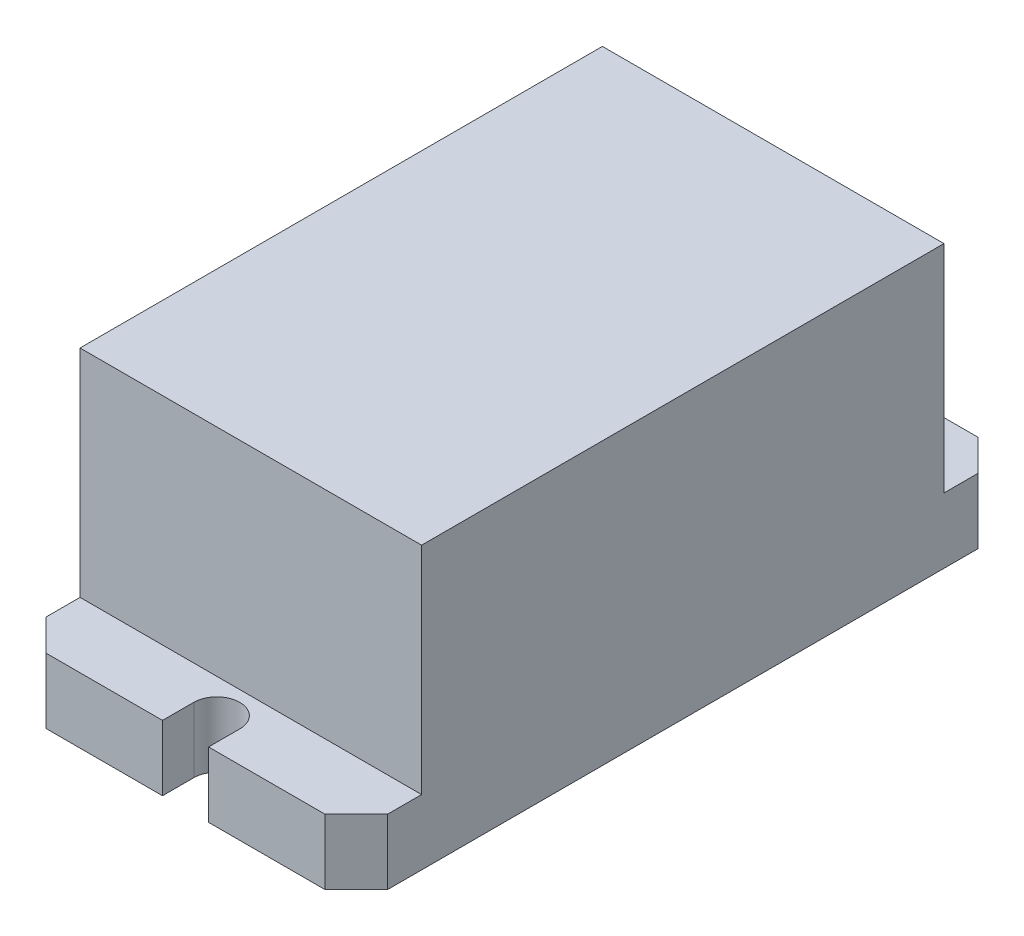
ISO-10303-21;
HEADER;
FILE_DESCRIPTION(('STEP AP214'),'2;1');
FILE_NAME('part.step','',(''),(''),'','','');
FILE_SCHEMA(('AUTOMOTIVE_DESIGN { 1 0 10303 214 1 1 1 1 }'));
ENDSEC;
DATA;
#1=APPLICATION_CONTEXT('core data for automotive mechanical design processes');
#2=APPLICATION_PROTOCOL_DEFINITION('international standard','automotive_design',2000,#1);
#3=PRODUCT_CONTEXT('',#1,'mechanical');
#4=PRODUCT('Part','Part','',(#3));
#5=PRODUCT_RELATED_PRODUCT_CATEGORY('part','',(#4));
#6=PRODUCT_DEFINITION_FORMATION('','',#4);
#7=PRODUCT_DEFINITION_CONTEXT('part definition',#1,'design');
#8=PRODUCT_DEFINITION('design','',#6,#7);
#9=PRODUCT_DEFINITION_SHAPE('','',#8);
#10=(LENGTH_UNIT() NAMED_UNIT(*) SI_UNIT(.MILLI.,.METRE.));
#11=(NAMED_UNIT(*) PLANE_ANGLE_UNIT() SI_UNIT($,.RADIAN.));
#12=(NAMED_UNIT(*) SI_UNIT($,.STERADIAN.) SOLID_ANGLE_UNIT());
#13=UNCERTAINTY_MEASURE_WITH_UNIT(LENGTH_MEASURE(1.E-05),#10,'distance_accuracy_value','');
#14=(GEOMETRIC_REPRESENTATION_CONTEXT(3) GLOBAL_UNCERTAINTY_ASSIGNED_CONTEXT((#13)) GLOBAL_UNIT_ASSIGNED_CONTEXT((#10,
#11,#12)) REPRESENTATION_CONTEXT('',''));
#15=CARTESIAN_POINT('',(0.,0.,0.));
#16=DIRECTION('',(0.,0.,1.));
#17=DIRECTION('',(1.,0.,0.));
#18=AXIS2_PLACEMENT_3D('',#15,#16,#17);
#19=CARTESIAN_POINT('',(0.,35.56,-33.02));
#20=DIRECTION('',(0.,0.,-1.));
#21=DIRECTION('',(-1.,0.,0.));
#22=AXIS2_PLACEMENT_3D('',#19,#20,#21);
#23=PLANE('',#22);
#24=DIRECTION('',(1.,0.,0.));
#25=VECTOR('',#24,1.);
#26=CARTESIAN_POINT('',(0.,8.255,-33.02));
#27=LINE('',#26,#25);
#28=CARTESIAN_POINT('',(-21.59,8.255,-33.02));
#29=VERTEX_POINT('',#28);
#30=CARTESIAN_POINT('',(21.59,8.255,-33.02));
#31=VERTEX_POINT('',#30);
#32=EDGE_CURVE('E56',#29,#31,#27,.T.);
#33=ORIENTED_EDGE('',*,*,#32,.F.);
#34=DIRECTION('',(0.,-1.,0.));
#35=VECTOR('',#34,1.);
#36=CARTESIAN_POINT('',(-21.59,35.56,-33.02));
#37=LINE('',#36,#35);
#38=CARTESIAN_POINT('',(-21.59,35.56,-33.02));
#39=VERTEX_POINT('',#38);
#40=EDGE_CURVE('E11',#39,#29,#37,.T.);
#41=ORIENTED_EDGE('',*,*,#40,.F.);
#42=DIRECTION('',(1.,0.,0.));
#43=VECTOR('',#42,1.);
#44=CARTESIAN_POINT('',(0.,35.56,-33.02));
#45=LINE('',#44,#43);
#46=CARTESIAN_POINT('',(21.59,35.56,-33.02));
#47=VERTEX_POINT('',#46);
#48=EDGE_CURVE('E362',#39,#47,#45,.T.);
#49=ORIENTED_EDGE('',*,*,#48,.T.);
#50=DIRECTION('',(0.,-1.,0.));
#51=VECTOR('',#50,1.);
#52=CARTESIAN_POINT('',(21.59,35.56,-33.02));
#53=LINE('',#52,#51);
#54=EDGE_CURVE('E258',#47,#31,#53,.T.);
#55=ORIENTED_EDGE('',*,*,#54,.T.);
#56=EDGE_LOOP('',(#33,#41,#49,#55));
#57=FACE_BOUND('',#56,.T.);
#58=ADVANCED_FACE('F41',(#57),#23,.T.);
#59=CARTESIAN_POINT('',(-21.59,35.56,0.));
#60=DIRECTION('',(-1.,0.,0.));
#61=DIRECTION('',(0.,0.,1.));
#62=AXIS2_PLACEMENT_3D('',#59,#60,#61);
#63=PLANE('',#62);
#64=DIRECTION('',(0.,0.,-1.));
#65=VECTOR('',#64,1.);
#66=CARTESIAN_POINT('',(-21.59,0.,0.));
#67=LINE('',#66,#65);
#68=CARTESIAN_POINT('',(-21.59,0.,37.3238335973469));
#69=VERTEX_POINT('',#68);
#70=CARTESIAN_POINT('',(-21.59,0.,-37.3238335973469));
#71=VERTEX_POINT('',#70);
#72=EDGE_CURVE('E361',#69,#71,#67,.T.);
#73=ORIENTED_EDGE('',*,*,#72,.F.);
#74=DIRECTION('',(0.,-1.,0.));
#75=VECTOR('',#74,1.);
#76=CARTESIAN_POINT('',(-21.59,8.255,37.3238335973469));
#77=LINE('',#76,#75);
#78=CARTESIAN_POINT('',(-21.59,8.255,37.3238335973469));
#79=VERTEX_POINT('',#78);
#80=EDGE_CURVE('E279',#79,#69,#77,.T.);
#81=ORIENTED_EDGE('',*,*,#80,.F.);
#82=DIRECTION('',(0.,0.,1.));
#83=VECTOR('',#82,1.);
#84=CARTESIAN_POINT('',(-21.59,8.255,0.));
#85=LINE('',#84,#83);
#86=CARTESIAN_POINT('',(-21.59,8.255,33.02));
#87=VERTEX_POINT('',#86);
#88=EDGE_CURVE('E272',#87,#79,#85,.T.);
#89=ORIENTED_EDGE('',*,*,#88,.F.);
#90=DIRECTION('',(0.,-1.,0.));
#91=VECTOR('',#90,1.);
#92=CARTESIAN_POINT('',(-21.59,35.56,33.02));
#93=LINE('',#92,#91);
#94=CARTESIAN_POINT('',(-21.59,35.56,33.02));
#95=VERTEX_POINT('',#94);
#96=EDGE_CURVE('E308',#95,#87,#93,.T.);
#97=ORIENTED_EDGE('',*,*,#96,.F.);
#98=DIRECTION('',(0.,0.,-1.));
#99=VECTOR('',#98,1.);
#100=CARTESIAN_POINT('',(-21.59,35.56,0.));
#101=LINE('',#100,#99);
#102=EDGE_CURVE('E49',#95,#39,#101,.T.);
#103=ORIENTED_EDGE('',*,*,#102,.T.);
#104=ORIENTED_EDGE('',*,*,#40,.T.);
#105=DIRECTION('',(0.,0.,-1.));
#106=VECTOR('',#105,1.);
#107=CARTESIAN_POINT('',(-21.59,8.255,0.));
#108=LINE('',#107,#106);
#109=CARTESIAN_POINT('',(-21.59,8.255,-37.3238335973469));
#110=VERTEX_POINT('',#109);
#111=EDGE_CURVE('E329',#29,#110,#108,.T.);
#112=ORIENTED_EDGE('',*,*,#111,.T.);
#113=DIRECTION('',(0.,-1.,0.));
#114=VECTOR('',#113,1.);
#115=CARTESIAN_POINT('',(-21.59,8.255,-37.3238335973469));
#116=LINE('',#115,#114);
#117=EDGE_CURVE('E335',#110,#71,#116,.T.);
#118=ORIENTED_EDGE('',*,*,#117,.T.);
#119=EDGE_LOOP('',(#73,#81,#89,#97,#103,#104,#112,#118));
#120=FACE_BOUND('',#119,.T.);
#121=ADVANCED_FACE('F375',(#120),#63,.T.);
#122=CARTESIAN_POINT('',(0.,35.56,0.));
#123=DIRECTION('',(0.,1.,0.));
#124=DIRECTION('',(0.,0.,1.));
#125=AXIS2_PLACEMENT_3D('',#122,#123,#124);
#126=PLANE('',#125);
#127=ORIENTED_EDGE('',*,*,#102,.F.);
#128=DIRECTION('',(1.,0.,0.));
#129=VECTOR('',#128,1.);
#130=CARTESIAN_POINT('',(0.,35.56,33.02));
#131=LINE('',#130,#129);
#132=CARTESIAN_POINT('',(21.59,35.56,33.02));
#133=VERTEX_POINT('',#132);
#134=EDGE_CURVE('E305',#95,#133,#131,.T.);
#135=ORIENTED_EDGE('',*,*,#134,.T.);
#136=DIRECTION('',(0.,0.,-1.));
#137=VECTOR('',#136,1.);
#138=CARTESIAN_POINT('',(21.59,35.56,0.));
#139=LINE('',#138,#137);
#140=EDGE_CURVE('E254',#133,#47,#139,.T.);
#141=ORIENTED_EDGE('',*,*,#140,.T.);
#142=ORIENTED_EDGE('',*,*,#48,.F.);
#143=EDGE_LOOP('',(#127,#135,#141,#142));
#144=FACE_BOUND('',#143,.T.);
#145=ADVANCED_FACE('F471',(#144),#126,.T.);
#146=CARTESIAN_POINT('',(0.,0.,0.));
#147=DIRECTION('',(0.,1.,0.));
#148=DIRECTION('',(0.,0.,1.));
#149=AXIS2_PLACEMENT_3D('',#146,#147,#148);
#150=PLANE('',#149);
#151=CARTESIAN_POINT('',(0.,0.,-37.3238335973469));
#152=DIRECTION('',(0.,1.,0.));
#153=DIRECTION('',(0.,0.,1.));
#154=AXIS2_PLACEMENT_3D('',#151,#152,#153);
#155=CIRCLE('',#154,2.90977199976751);
#156=CARTESIAN_POINT('',(-2.90977199976751,0.,-37.3238335973469));
#157=VERTEX_POINT('',#156);
#158=CARTESIAN_POINT('',(2.90977199976753,0.,-37.3238335973469));
#159=VERTEX_POINT('',#158);
#160=EDGE_CURVE('E312',#157,#159,#155,.T.);
#161=ORIENTED_EDGE('',*,*,#160,.T.);
#162=DIRECTION('',(0.,0.,1.));
#163=VECTOR('',#162,1.);
#164=CARTESIAN_POINT('',(2.90977199976751,0.,0.));
#165=LINE('',#164,#163);
#166=CARTESIAN_POINT('',(2.90977199976753,0.,-41.275));
#167=VERTEX_POINT('',#166);
#168=EDGE_CURVE('E208',#167,#159,#165,.T.);
#169=ORIENTED_EDGE('',*,*,#168,.F.);
#170=DIRECTION('',(-1.,0.,0.));
#171=VECTOR('',#170,1.);
#172=CARTESIAN_POINT('',(0.,0.,-41.275));
#173=LINE('',#172,#171);
#174=CARTESIAN_POINT('',(17.638833597347,0.,-41.275));
#175=VERTEX_POINT('',#174);
#176=EDGE_CURVE('E233',#175,#167,#173,.T.);
#177=ORIENTED_EDGE('',*,*,#176,.F.);
#178=DIRECTION('',(-0.707106781186541,0.,-0.707106781186554));
#179=VECTOR('',#178,1.);
#180=CARTESIAN_POINT('',(29.4569167986737,0.,-29.4569167986731));
#181=LINE('',#180,#179);
#182=CARTESIAN_POINT('',(21.59,0.,-37.3238335973469));
#183=VERTEX_POINT('',#182);
#184=EDGE_CURVE('E219',#183,#175,#181,.T.);
#185=ORIENTED_EDGE('',*,*,#184,.F.);
#186=DIRECTION('',(0.,0.,-1.));
#187=VECTOR('',#186,1.);
#188=CARTESIAN_POINT('',(21.59,0.,0.));
#189=LINE('',#188,#187);
#190=CARTESIAN_POINT('',(21.59,0.,37.3238335973469));
#191=VERTEX_POINT('',#190);
#192=EDGE_CURVE('E253',#191,#183,#189,.T.);
#193=ORIENTED_EDGE('',*,*,#192,.F.);
#194=DIRECTION('',(-0.707106781186542,0.,0.707106781186554));
#195=VECTOR('',#194,1.);
#196=CARTESIAN_POINT('',(29.4569167986736,0.,29.4569167986731));
#197=LINE('',#196,#195);
#198=CARTESIAN_POINT('',(17.638833597347,0.,41.275));
#199=VERTEX_POINT('',#198);
#200=EDGE_CURVE('E197',#191,#199,#197,.T.);
#201=ORIENTED_EDGE('',*,*,#200,.T.);
#202=DIRECTION('',(-1.,0.,0.));
#203=VECTOR('',#202,1.);
#204=CARTESIAN_POINT('',(0.,0.,41.275));
#205=LINE('',#204,#203);
#206=CARTESIAN_POINT('',(2.90977199976748,0.,41.275));
#207=VERTEX_POINT('',#206);
#208=EDGE_CURVE('E417',#199,#207,#205,.T.);
#209=ORIENTED_EDGE('',*,*,#208,.T.);
#210=DIRECTION('',(0.,0.,-1.));
#211=VECTOR('',#210,1.);
#212=CARTESIAN_POINT('',(2.90977199976751,0.,0.));
#213=LINE('',#212,#211);
#214=CARTESIAN_POINT('',(2.90977199976749,0.,37.3238335973469));
#215=VERTEX_POINT('',#214);
#216=EDGE_CURVE('E422',#207,#215,#213,.T.);
#217=ORIENTED_EDGE('',*,*,#216,.T.);
#218=CARTESIAN_POINT('',(0.,0.,37.3238335973469));
#219=DIRECTION('',(0.,-1.,0.));
#220=DIRECTION('',(0.,0.,-1.));
#221=AXIS2_PLACEMENT_3D('',#218,#219,#220);
#222=CIRCLE('',#221,2.90977199976751);
#223=CARTESIAN_POINT('',(-2.9097719997675,0.,37.3238335973469));
#224=VERTEX_POINT('',#223);
#225=EDGE_CURVE('E201',#224,#215,#222,.T.);
#226=ORIENTED_EDGE('',*,*,#225,.F.);
#227=DIRECTION('',(0.,0.,-1.));
#228=VECTOR('',#227,1.);
#229=CARTESIAN_POINT('',(-2.90977199976751,0.,0.));
#230=LINE('',#229,#228);
#231=CARTESIAN_POINT('',(-2.9097719997675,0.,41.275));
#232=VERTEX_POINT('',#231);
#233=EDGE_CURVE('E282',#232,#224,#230,.T.);
#234=ORIENTED_EDGE('',*,*,#233,.F.);
#235=DIRECTION('',(1.,0.,0.));
#236=VECTOR('',#235,1.);
#237=CARTESIAN_POINT('',(0.,0.,41.275));
#238=LINE('',#237,#236);
#239=CARTESIAN_POINT('',(-17.638833597347,0.,41.275));
#240=VERTEX_POINT('',#239);
#241=EDGE_CURVE('E286',#240,#232,#238,.T.);
#242=ORIENTED_EDGE('',*,*,#241,.F.);
#243=DIRECTION('',(0.707106781186541,0.,0.707106781186554));
#244=VECTOR('',#243,1.);
#245=CARTESIAN_POINT('',(-29.4569167986737,0.,29.4569167986731));
#246=LINE('',#245,#244);
#247=EDGE_CURVE('E186',#69,#240,#246,.T.);
#248=ORIENTED_EDGE('',*,*,#247,.F.);
#249=ORIENTED_EDGE('',*,*,#72,.T.);
#250=DIRECTION('',(0.707106781186541,0.,-0.707106781186554));
#251=VECTOR('',#250,1.);
#252=CARTESIAN_POINT('',(-29.4569167986737,0.,-29.4569167986731));
#253=LINE('',#252,#251);
#254=CARTESIAN_POINT('',(-17.638833597347,0.,-41.275));
#255=VERTEX_POINT('',#254);
#256=EDGE_CURVE('E317',#71,#255,#253,.T.);
#257=ORIENTED_EDGE('',*,*,#256,.T.);
#258=DIRECTION('',(1.,0.,0.));
#259=VECTOR('',#258,1.);
#260=CARTESIAN_POINT('',(0.,0.,-41.275));
#261=LINE('',#260,#259);
#262=CARTESIAN_POINT('',(-2.90977199976751,0.,-41.275));
#263=VERTEX_POINT('',#262);
#264=EDGE_CURVE('E342',#255,#263,#261,.T.);
#265=ORIENTED_EDGE('',*,*,#264,.T.);
#266=DIRECTION('',(0.,0.,1.));
#267=VECTOR('',#266,1.);
#268=CARTESIAN_POINT('',(-2.90977199976751,0.,0.));
#269=LINE('',#268,#267);
#270=EDGE_CURVE('E338',#263,#157,#269,.T.);
#271=ORIENTED_EDGE('',*,*,#270,.T.);
#272=EDGE_LOOP('',(#161,#169,#177,#185,#193,#201,#209,#217,#226,#234,#242,#248,#249,#257,#265,#271));
#273=FACE_BOUND('',#272,.T.);
#274=ADVANCED_FACE('F370',(#273),#150,.F.);
#275=CARTESIAN_POINT('',(0.,8.255,-37.3238335973469));
#276=DIRECTION('',(0.,-1.,0.));
#277=DIRECTION('',(0.,0.,-1.));
#278=AXIS2_PLACEMENT_3D('',#275,#276,#277);
#279=CYLINDRICAL_SURFACE('',#278,2.90977199976751);
#280=ORIENTED_EDGE('',*,*,#160,.F.);
#281=DIRECTION('',(0.,-1.,0.));
#282=VECTOR('',#281,1.);
#283=CARTESIAN_POINT('',(-2.90977199976751,8.255,-37.3238335973469));
#284=LINE('',#283,#282);
#285=CARTESIAN_POINT('',(-2.90977199976751,8.255,-37.3238335973469));
#286=VERTEX_POINT('',#285);
#287=EDGE_CURVE('E358',#286,#157,#284,.T.);
#288=ORIENTED_EDGE('',*,*,#287,.F.);
#289=CARTESIAN_POINT('',(0.,8.255,-37.3238335973469));
#290=DIRECTION('',(0.,1.,0.));
#291=DIRECTION('',(0.,0.,1.));
#292=AXIS2_PLACEMENT_3D('',#289,#290,#291);
#293=CIRCLE('',#292,2.90977199976751);
#294=CARTESIAN_POINT('',(2.90977199976753,8.255,-37.3238335973469));
#295=VERTEX_POINT('',#294);
#296=EDGE_CURVE('E313',#286,#295,#293,.T.);
#297=ORIENTED_EDGE('',*,*,#296,.T.);
#298=DIRECTION('',(0.,-1.,0.));
#299=VECTOR('',#298,1.);
#300=CARTESIAN_POINT('',(2.90977199976753,8.255,-37.3238335973469));
#301=LINE('',#300,#299);
#302=EDGE_CURVE('E249',#295,#159,#301,.T.);
#303=ORIENTED_EDGE('',*,*,#302,.T.);
#304=EDGE_LOOP('',(#280,#288,#297,#303));
#305=FACE_BOUND('',#304,.T.);
#306=ADVANCED_FACE('F392',(#305),#279,.F.);
#307=CARTESIAN_POINT('',(-2.90977199976751,8.255,0.));
#308=DIRECTION('',(1.,0.,0.));
#309=DIRECTION('',(0.,0.,-1.));
#310=AXIS2_PLACEMENT_3D('',#307,#308,#309);
#311=PLANE('',#310);
#312=ORIENTED_EDGE('',*,*,#270,.F.);
#313=DIRECTION('',(0.,-1.,0.));
#314=VECTOR('',#313,1.);
#315=CARTESIAN_POINT('',(-2.90977199976751,8.255,-41.275));
#316=LINE('',#315,#314);
#317=CARTESIAN_POINT('',(-2.90977199976751,8.255,-41.275));
#318=VERTEX_POINT('',#317);
#319=EDGE_CURVE('E355',#318,#263,#316,.T.);
#320=ORIENTED_EDGE('',*,*,#319,.F.);
#321=DIRECTION('',(0.,0.,1.));
#322=VECTOR('',#321,1.);
#323=CARTESIAN_POINT('',(-2.90977199976751,8.255,0.));
#324=LINE('',#323,#322);
#325=EDGE_CURVE('E316',#318,#286,#324,.T.);
#326=ORIENTED_EDGE('',*,*,#325,.T.);
#327=ORIENTED_EDGE('',*,*,#287,.T.);
#328=EDGE_LOOP('',(#312,#320,#326,#327));
#329=FACE_BOUND('',#328,.T.);
#330=ADVANCED_FACE('F388',(#329),#311,.T.);
#331=CARTESIAN_POINT('',(0.,8.255,-41.275));
#332=DIRECTION('',(0.,0.,-1.));
#333=DIRECTION('',(-1.,0.,0.));
#334=AXIS2_PLACEMENT_3D('',#331,#332,#333);
#335=PLANE('',#334);
#336=ORIENTED_EDGE('',*,*,#264,.F.);
#337=DIRECTION('',(0.,-1.,0.));
#338=VECTOR('',#337,1.);
#339=CARTESIAN_POINT('',(-17.638833597347,8.255,-41.275));
#340=LINE('',#339,#338);
#341=CARTESIAN_POINT('',(-17.638833597347,8.255,-41.275));
#342=VERTEX_POINT('',#341);
#343=EDGE_CURVE('E352',#342,#255,#340,.T.);
#344=ORIENTED_EDGE('',*,*,#343,.F.);
#345=DIRECTION('',(1.,0.,0.));
#346=VECTOR('',#345,1.);
#347=CARTESIAN_POINT('',(0.,8.255,-41.275));
#348=LINE('',#347,#346);
#349=EDGE_CURVE('E321',#342,#318,#348,.T.);
#350=ORIENTED_EDGE('',*,*,#349,.T.);
#351=ORIENTED_EDGE('',*,*,#319,.T.);
#352=EDGE_LOOP('',(#336,#344,#350,#351));
#353=FACE_BOUND('',#352,.T.);
#354=ADVANCED_FACE('F383',(#353),#335,.T.);
#355=CARTESIAN_POINT('',(-29.4569167986737,8.255,-29.4569167986731));
#356=DIRECTION('',(-0.707106781186554,0.,-0.707106781186541));
#357=DIRECTION('',(-0.707106781186541,0.,0.707106781186554));
#358=AXIS2_PLACEMENT_3D('',#355,#356,#357);
#359=PLANE('',#358);
#360=ORIENTED_EDGE('',*,*,#256,.F.);
#361=ORIENTED_EDGE('',*,*,#117,.F.);
#362=DIRECTION('',(0.707106781186541,0.,-0.707106781186554));
#363=VECTOR('',#362,1.);
#364=CARTESIAN_POINT('',(-29.4569167986737,8.255,-29.4569167986731));
#365=LINE('',#364,#363);
#366=EDGE_CURVE('E325',#110,#342,#365,.T.);
#367=ORIENTED_EDGE('',*,*,#366,.T.);
#368=ORIENTED_EDGE('',*,*,#343,.T.);
#369=EDGE_LOOP('',(#360,#361,#367,#368));
#370=FACE_BOUND('',#369,.T.);
#371=ADVANCED_FACE('F379',(#370),#359,.T.);
#372=CARTESIAN_POINT('',(0.,8.255,0.));
#373=DIRECTION('',(0.,1.,0.));
#374=DIRECTION('',(0.,0.,1.));
#375=AXIS2_PLACEMENT_3D('',#372,#373,#374);
#376=PLANE('',#375);
#377=ORIENTED_EDGE('',*,*,#296,.F.);
#378=ORIENTED_EDGE('',*,*,#325,.F.);
#379=ORIENTED_EDGE('',*,*,#349,.F.);
#380=ORIENTED_EDGE('',*,*,#366,.F.);
#381=ORIENTED_EDGE('',*,*,#111,.F.);
#382=ORIENTED_EDGE('',*,*,#32,.T.);
#383=DIRECTION('',(0.,0.,-1.));
#384=VECTOR('',#383,1.);
#385=CARTESIAN_POINT('',(21.59,8.255,0.));
#386=LINE('',#385,#384);
#387=CARTESIAN_POINT('',(21.59,8.255,-37.3238335973469));
#388=VERTEX_POINT('',#387);
#389=EDGE_CURVE('E225',#31,#388,#386,.T.);
#390=ORIENTED_EDGE('',*,*,#389,.T.);
#391=DIRECTION('',(-0.707106781186541,0.,-0.707106781186554));
#392=VECTOR('',#391,1.);
#393=CARTESIAN_POINT('',(29.4569167986737,8.255,-29.4569167986731));
#394=LINE('',#393,#392);
#395=CARTESIAN_POINT('',(17.638833597347,8.255,-41.275));
#396=VERTEX_POINT('',#395);
#397=EDGE_CURVE('E222',#388,#396,#394,.T.);
#398=ORIENTED_EDGE('',*,*,#397,.T.);
#399=DIRECTION('',(-1.,0.,0.));
#400=VECTOR('',#399,1.);
#401=CARTESIAN_POINT('',(0.,8.255,-41.275));
#402=LINE('',#401,#400);
#403=CARTESIAN_POINT('',(2.90977199976753,8.255,-41.275));
#404=VERTEX_POINT('',#403);
#405=EDGE_CURVE('E218',#396,#404,#402,.T.);
#406=ORIENTED_EDGE('',*,*,#405,.T.);
#407=DIRECTION('',(0.,0.,1.));
#408=VECTOR('',#407,1.);
#409=CARTESIAN_POINT('',(2.90977199976751,8.255,0.));
#410=LINE('',#409,#408);
#411=EDGE_CURVE('E214',#404,#295,#410,.T.);
#412=ORIENTED_EDGE('',*,*,#411,.T.);
#413=EDGE_LOOP('',(#377,#378,#379,#380,#381,#382,#390,#398,#406,#412));
#414=FACE_BOUND('',#413,.T.);
#415=ADVANCED_FACE('F488',(#414),#376,.T.);
#416=CARTESIAN_POINT('',(0.,35.56,33.02));
#417=DIRECTION('',(0.,0.,1.));
#418=DIRECTION('',(-1.,0.,0.));
#419=AXIS2_PLACEMENT_3D('',#416,#417,#418);
#420=PLANE('',#419);
#421=DIRECTION('',(1.,0.,0.));
#422=VECTOR('',#421,1.);
#423=CARTESIAN_POINT('',(0.,8.255,33.02));
#424=LINE('',#423,#422);
#425=CARTESIAN_POINT('',(21.59,8.255,33.02));
#426=VERTEX_POINT('',#425);
#427=EDGE_CURVE('E276',#87,#426,#424,.T.);
#428=ORIENTED_EDGE('',*,*,#427,.T.);
#429=DIRECTION('',(0.,-1.,0.));
#430=VECTOR('',#429,1.);
#431=CARTESIAN_POINT('',(21.59,35.56,33.02));
#432=LINE('',#431,#430);
#433=EDGE_CURVE('E203',#133,#426,#432,.T.);
#434=ORIENTED_EDGE('',*,*,#433,.F.);
#435=ORIENTED_EDGE('',*,*,#134,.F.);
#436=ORIENTED_EDGE('',*,*,#96,.T.);
#437=EDGE_LOOP('',(#428,#434,#435,#436));
#438=FACE_BOUND('',#437,.T.);
#439=ADVANCED_FACE('F446',(#438),#420,.T.);
#440=CARTESIAN_POINT('',(0.,8.255,37.3238335973469));
#441=DIRECTION('',(0.,-1.,0.));
#442=DIRECTION('',(0.,0.,1.));
#443=AXIS2_PLACEMENT_3D('',#440,#441,#442);
#444=CYLINDRICAL_SURFACE('',#443,2.90977199976751);
#445=ORIENTED_EDGE('',*,*,#225,.T.);
#446=DIRECTION('',(0.,-1.,0.));
#447=VECTOR('',#446,1.);
#448=CARTESIAN_POINT('',(2.90977199976749,8.255,37.3238335973469));
#449=LINE('',#448,#447);
#450=CARTESIAN_POINT('',(2.90977199976749,8.255,37.3238335973469));
#451=VERTEX_POINT('',#450);
#452=EDGE_CURVE('E192',#451,#215,#449,.T.);
#453=ORIENTED_EDGE('',*,*,#452,.F.);
#454=CARTESIAN_POINT('',(0.,8.255,37.3238335973469));
#455=DIRECTION('',(0.,-1.,0.));
#456=DIRECTION('',(0.,0.,-1.));
#457=AXIS2_PLACEMENT_3D('',#454,#455,#456);
#458=CIRCLE('',#457,2.90977199976751);
#459=CARTESIAN_POINT('',(-2.9097719997675,8.255,37.3238335973469));
#460=VERTEX_POINT('',#459);
#461=EDGE_CURVE('E174',#460,#451,#458,.T.);
#462=ORIENTED_EDGE('',*,*,#461,.F.);
#463=DIRECTION('',(0.,-1.,0.));
#464=VECTOR('',#463,1.);
#465=CARTESIAN_POINT('',(-2.9097719997675,8.255,37.3238335973469));
#466=LINE('',#465,#464);
#467=EDGE_CURVE('E302',#460,#224,#466,.T.);
#468=ORIENTED_EDGE('',*,*,#467,.T.);
#469=EDGE_LOOP('',(#445,#453,#462,#468));
#470=FACE_BOUND('',#469,.T.);
#471=ADVANCED_FACE('F199',(#470),#444,.F.);
#472=CARTESIAN_POINT('',(-2.90977199976751,8.255,0.));
#473=DIRECTION('',(1.,0.,0.));
#474=DIRECTION('',(0.,0.,1.));
#475=AXIS2_PLACEMENT_3D('',#472,#473,#474);
#476=PLANE('',#475);
#477=ORIENTED_EDGE('',*,*,#233,.T.);
#478=ORIENTED_EDGE('',*,*,#467,.F.);
#479=DIRECTION('',(0.,0.,-1.));
#480=VECTOR('',#479,1.);
#481=CARTESIAN_POINT('',(-2.90977199976751,8.255,0.));
#482=LINE('',#481,#480);
#483=CARTESIAN_POINT('',(-2.9097719997675,8.255,41.275));
#484=VERTEX_POINT('',#483);
#485=EDGE_CURVE('E181',#484,#460,#482,.T.);
#486=ORIENTED_EDGE('',*,*,#485,.F.);
#487=DIRECTION('',(0.,-1.,0.));
#488=VECTOR('',#487,1.);
#489=CARTESIAN_POINT('',(-2.9097719997675,8.255,41.275));
#490=LINE('',#489,#488);
#491=EDGE_CURVE('E299',#484,#232,#490,.T.);
#492=ORIENTED_EDGE('',*,*,#491,.T.);
#493=EDGE_LOOP('',(#477,#478,#486,#492));
#494=FACE_BOUND('',#493,.T.);
#495=ADVANCED_FACE('F458',(#494),#476,.T.);
#496=CARTESIAN_POINT('',(0.,8.255,41.275));
#497=DIRECTION('',(0.,0.,1.));
#498=DIRECTION('',(-1.,0.,0.));
#499=AXIS2_PLACEMENT_3D('',#496,#497,#498);
#500=PLANE('',#499);
#501=ORIENTED_EDGE('',*,*,#241,.T.);
#502=ORIENTED_EDGE('',*,*,#491,.F.);
#503=DIRECTION('',(1.,0.,0.));
#504=VECTOR('',#503,1.);
#505=CARTESIAN_POINT('',(0.,8.255,41.275));
#506=LINE('',#505,#504);
#507=CARTESIAN_POINT('',(-17.638833597347,8.255,41.275));
#508=VERTEX_POINT('',#507);
#509=EDGE_CURVE('E266',#508,#484,#506,.T.);
#510=ORIENTED_EDGE('',*,*,#509,.F.);
#511=DIRECTION('',(0.,-1.,0.));
#512=VECTOR('',#511,1.);
#513=CARTESIAN_POINT('',(-17.638833597347,8.255,41.275));
#514=LINE('',#513,#512);
#515=EDGE_CURVE('E296',#508,#240,#514,.T.);
#516=ORIENTED_EDGE('',*,*,#515,.T.);
#517=EDGE_LOOP('',(#501,#502,#510,#516));
#518=FACE_BOUND('',#517,.T.);
#519=ADVANCED_FACE('F455',(#518),#500,.T.);
#520=CARTESIAN_POINT('',(-29.4569167986737,8.255,29.4569167986731));
#521=DIRECTION('',(-0.707106781186554,0.,0.707106781186541));
#522=DIRECTION('',(-0.707106781186541,0.,-0.707106781186554));
#523=AXIS2_PLACEMENT_3D('',#520,#521,#522);
#524=PLANE('',#523);
#525=ORIENTED_EDGE('',*,*,#247,.T.);
#526=ORIENTED_EDGE('',*,*,#515,.F.);
#527=DIRECTION('',(0.707106781186541,0.,0.707106781186554));
#528=VECTOR('',#527,1.);
#529=CARTESIAN_POINT('',(-29.4569167986737,8.255,29.4569167986731));
#530=LINE('',#529,#528);
#531=EDGE_CURVE('E269',#79,#508,#530,.T.);
#532=ORIENTED_EDGE('',*,*,#531,.F.);
#533=ORIENTED_EDGE('',*,*,#80,.T.);
#534=EDGE_LOOP('',(#525,#526,#532,#533));
#535=FACE_BOUND('',#534,.T.);
#536=ADVANCED_FACE('F450',(#535),#524,.T.);
#537=CARTESIAN_POINT('',(0.,8.255,0.));
#538=DIRECTION('',(0.,1.,0.));
#539=DIRECTION('',(0.,0.,-1.));
#540=AXIS2_PLACEMENT_3D('',#537,#538,#539);
#541=PLANE('',#540);
#542=ORIENTED_EDGE('',*,*,#461,.T.);
#543=DIRECTION('',(0.,0.,-1.));
#544=VECTOR('',#543,1.);
#545=CARTESIAN_POINT('',(2.90977199976751,8.255,0.));
#546=LINE('',#545,#544);
#547=CARTESIAN_POINT('',(2.90977199976748,8.255,41.275));
#548=VERTEX_POINT('',#547);
#549=EDGE_CURVE('E178',#548,#451,#546,.T.);
#550=ORIENTED_EDGE('',*,*,#549,.F.);
#551=DIRECTION('',(-1.,0.,0.));
#552=VECTOR('',#551,1.);
#553=CARTESIAN_POINT('',(0.,8.255,41.275));
#554=LINE('',#553,#552);
#555=CARTESIAN_POINT('',(17.638833597347,8.255,41.275));
#556=VERTEX_POINT('',#555);
#557=EDGE_CURVE('E196',#556,#548,#554,.T.);
#558=ORIENTED_EDGE('',*,*,#557,.F.);
#559=DIRECTION('',(-0.707106781186542,0.,0.707106781186554));
#560=VECTOR('',#559,1.);
#561=CARTESIAN_POINT('',(29.4569167986736,8.255,29.4569167986731));
#562=LINE('',#561,#560);
#563=CARTESIAN_POINT('',(21.59,8.255,37.3238335973469));
#564=VERTEX_POINT('',#563);
#565=EDGE_CURVE('E431',#564,#556,#562,.T.);
#566=ORIENTED_EDGE('',*,*,#565,.F.);
#567=DIRECTION('',(0.,0.,1.));
#568=VECTOR('',#567,1.);
#569=CARTESIAN_POINT('',(21.59,8.255,0.));
#570=LINE('',#569,#568);
#571=EDGE_CURVE('E427',#426,#564,#570,.T.);
#572=ORIENTED_EDGE('',*,*,#571,.F.);
#573=ORIENTED_EDGE('',*,*,#427,.F.);
#574=ORIENTED_EDGE('',*,*,#88,.T.);
#575=ORIENTED_EDGE('',*,*,#531,.T.);
#576=ORIENTED_EDGE('',*,*,#509,.T.);
#577=ORIENTED_EDGE('',*,*,#485,.T.);
#578=EDGE_LOOP('',(#542,#550,#558,#566,#572,#573,#574,#575,#576,#577));
#579=FACE_BOUND('',#578,.T.);
#580=ADVANCED_FACE('F176',(#579),#541,.T.);
#581=CARTESIAN_POINT('',(21.59,35.56,0.));
#582=DIRECTION('',(1.,0.,0.));
#583=DIRECTION('',(0.,0.,1.));
#584=AXIS2_PLACEMENT_3D('',#581,#582,#583);
#585=PLANE('',#584);
#586=ORIENTED_EDGE('',*,*,#192,.T.);
#587=DIRECTION('',(0.,-1.,0.));
#588=VECTOR('',#587,1.);
#589=CARTESIAN_POINT('',(21.59,8.255,-37.3238335973469));
#590=LINE('',#589,#588);
#591=EDGE_CURVE('E229',#388,#183,#590,.T.);
#592=ORIENTED_EDGE('',*,*,#591,.F.);
#593=ORIENTED_EDGE('',*,*,#389,.F.);
#594=ORIENTED_EDGE('',*,*,#54,.F.);
#595=ORIENTED_EDGE('',*,*,#140,.F.);
#596=ORIENTED_EDGE('',*,*,#433,.T.);
#597=ORIENTED_EDGE('',*,*,#571,.T.);
#598=DIRECTION('',(0.,-1.,0.));
#599=VECTOR('',#598,1.);
#600=CARTESIAN_POINT('',(21.59,8.255,37.3238335973469));
#601=LINE('',#600,#599);
#602=EDGE_CURVE('E413',#564,#191,#601,.T.);
#603=ORIENTED_EDGE('',*,*,#602,.T.);
#604=EDGE_LOOP('',(#586,#592,#593,#594,#595,#596,#597,#603));
#605=FACE_BOUND('',#604,.T.);
#606=ADVANCED_FACE('F410',(#605),#585,.T.);
#607=CARTESIAN_POINT('',(2.90977199976751,8.255,0.));
#608=DIRECTION('',(-1.,0.,0.));
#609=DIRECTION('',(0.,0.,-1.));
#610=AXIS2_PLACEMENT_3D('',#607,#608,#609);
#611=PLANE('',#610);
#612=ORIENTED_EDGE('',*,*,#168,.T.);
#613=ORIENTED_EDGE('',*,*,#302,.F.);
#614=ORIENTED_EDGE('',*,*,#411,.F.);
#615=DIRECTION('',(0.,-1.,0.));
#616=VECTOR('',#615,1.);
#617=CARTESIAN_POINT('',(2.90977199976753,8.255,-41.275));
#618=LINE('',#617,#616);
#619=EDGE_CURVE('E246',#404,#167,#618,.T.);
#620=ORIENTED_EDGE('',*,*,#619,.T.);
#621=EDGE_LOOP('',(#612,#613,#614,#620));
#622=FACE_BOUND('',#621,.T.);
#623=ADVANCED_FACE('F396',(#622),#611,.T.);
#624=CARTESIAN_POINT('',(0.,8.255,-41.275));
#625=DIRECTION('',(0.,0.,-1.));
#626=DIRECTION('',(1.,0.,0.));
#627=AXIS2_PLACEMENT_3D('',#624,#625,#626);
#628=PLANE('',#627);
#629=ORIENTED_EDGE('',*,*,#176,.T.);
#630=ORIENTED_EDGE('',*,*,#619,.F.);
#631=ORIENTED_EDGE('',*,*,#405,.F.);
#632=DIRECTION('',(0.,-1.,0.));
#633=VECTOR('',#632,1.);
#634=CARTESIAN_POINT('',(17.638833597347,8.255,-41.275));
#635=LINE('',#634,#633);
#636=EDGE_CURVE('E243',#396,#175,#635,.T.);
#637=ORIENTED_EDGE('',*,*,#636,.T.);
#638=EDGE_LOOP('',(#629,#630,#631,#637));
#639=FACE_BOUND('',#638,.T.);
#640=ADVANCED_FACE('F401',(#639),#628,.T.);
#641=CARTESIAN_POINT('',(29.4569167986737,8.255,-29.4569167986731));
#642=DIRECTION('',(0.707106781186554,0.,-0.707106781186541));
#643=DIRECTION('',(0.707106781186541,0.,0.707106781186554));
#644=AXIS2_PLACEMENT_3D('',#641,#642,#643);
#645=PLANE('',#644);
#646=ORIENTED_EDGE('',*,*,#184,.T.);
#647=ORIENTED_EDGE('',*,*,#636,.F.);
#648=ORIENTED_EDGE('',*,*,#397,.F.);
#649=ORIENTED_EDGE('',*,*,#591,.T.);
#650=EDGE_LOOP('',(#646,#647,#648,#649));
#651=FACE_BOUND('',#650,.T.);
#652=ADVANCED_FACE('F405',(#651),#645,.T.);
#653=CARTESIAN_POINT('',(2.90977199976751,8.255,0.));
#654=DIRECTION('',(-1.,0.,0.));
#655=DIRECTION('',(0.,0.,1.));
#656=AXIS2_PLACEMENT_3D('',#653,#654,#655);
#657=PLANE('',#656);
#658=ORIENTED_EDGE('',*,*,#216,.F.);
#659=DIRECTION('',(0.,-1.,0.));
#660=VECTOR('',#659,1.);
#661=CARTESIAN_POINT('',(2.90977199976748,8.255,41.275));
#662=LINE('',#661,#660);
#663=EDGE_CURVE('E194',#548,#207,#662,.T.);
#664=ORIENTED_EDGE('',*,*,#663,.F.);
#665=ORIENTED_EDGE('',*,*,#549,.T.);
#666=ORIENTED_EDGE('',*,*,#452,.T.);
#667=EDGE_LOOP('',(#658,#664,#665,#666));
#668=FACE_BOUND('',#667,.T.);
#669=ADVANCED_FACE('F191',(#668),#657,.T.);
#670=CARTESIAN_POINT('',(0.,8.255,41.275));
#671=DIRECTION('',(0.,0.,1.));
#672=DIRECTION('',(1.,0.,0.));
#673=AXIS2_PLACEMENT_3D('',#670,#671,#672);
#674=PLANE('',#673);
#675=ORIENTED_EDGE('',*,*,#208,.F.);
#676=DIRECTION('',(0.,-1.,0.));
#677=VECTOR('',#676,1.);
#678=CARTESIAN_POINT('',(17.638833597347,8.255,41.275));
#679=LINE('',#678,#677);
#680=EDGE_CURVE('E210',#556,#199,#679,.T.);
#681=ORIENTED_EDGE('',*,*,#680,.F.);
#682=ORIENTED_EDGE('',*,*,#557,.T.);
#683=ORIENTED_EDGE('',*,*,#663,.T.);
#684=EDGE_LOOP('',(#675,#681,#682,#683));
#685=FACE_BOUND('',#684,.T.);
#686=ADVANCED_FACE('F433',(#685),#674,.T.);
#687=CARTESIAN_POINT('',(29.4569167986736,8.255,29.4569167986731));
#688=DIRECTION('',(0.707106781186554,0.,0.707106781186542));
#689=DIRECTION('',(0.707106781186542,0.,-0.707106781186554));
#690=AXIS2_PLACEMENT_3D('',#687,#688,#689);
#691=PLANE('',#690);
#692=ORIENTED_EDGE('',*,*,#200,.F.);
#693=ORIENTED_EDGE('',*,*,#602,.F.);
#694=ORIENTED_EDGE('',*,*,#565,.T.);
#695=ORIENTED_EDGE('',*,*,#680,.T.);
#696=EDGE_LOOP('',(#692,#693,#694,#695));
#697=FACE_BOUND('',#696,.T.);
#698=ADVANCED_FACE('F430',(#697),#691,.T.);
#699=CLOSED_SHELL('',(#58,#121,#145,#274,#306,#330,#354,#371,#415,#439,#471,#495,#519,#536,#580,
#606,#623,#640,#652,#669,#686,#698));
#700=MANIFOLD_SOLID_BREP('B2',#699);
#701=ADVANCED_BREP_SHAPE_REPRESENTATION('',(#18,#700),#14);
#702=SHAPE_DEFINITION_REPRESENTATION(#9,#701);
ENDSEC;
END-ISO-10303-21;
